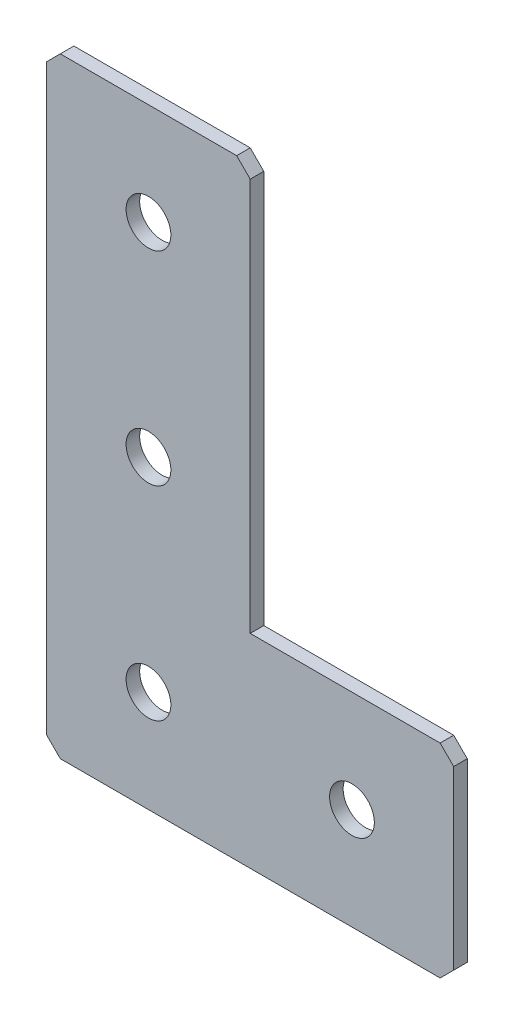
ISO-10303-21;
HEADER;
FILE_DESCRIPTION(('STEP AP214'),'2;1');
FILE_NAME('part.step','',(''),(''),'','','');
FILE_SCHEMA(('AUTOMOTIVE_DESIGN { 1 0 10303 214 1 1 1 1 }'));
ENDSEC;
DATA;
#1=APPLICATION_CONTEXT('core data for automotive mechanical design processes');
#2=APPLICATION_PROTOCOL_DEFINITION('international standard','automotive_design',2000,#1);
#3=PRODUCT_CONTEXT('',#1,'mechanical');
#4=PRODUCT('Part','Part','',(#3));
#5=PRODUCT_RELATED_PRODUCT_CATEGORY('part','',(#4));
#6=PRODUCT_DEFINITION_FORMATION('','',#4);
#7=PRODUCT_DEFINITION_CONTEXT('part definition',#1,'design');
#8=PRODUCT_DEFINITION('design','',#6,#7);
#9=PRODUCT_DEFINITION_SHAPE('','',#8);
#10=(LENGTH_UNIT() NAMED_UNIT(*) SI_UNIT(.MILLI.,.METRE.));
#11=(NAMED_UNIT(*) PLANE_ANGLE_UNIT() SI_UNIT($,.RADIAN.));
#12=(NAMED_UNIT(*) SI_UNIT($,.STERADIAN.) SOLID_ANGLE_UNIT());
#13=UNCERTAINTY_MEASURE_WITH_UNIT(LENGTH_MEASURE(1.E-05),#10,'distance_accuracy_value','');
#14=(GEOMETRIC_REPRESENTATION_CONTEXT(3) GLOBAL_UNCERTAINTY_ASSIGNED_CONTEXT((#13)) GLOBAL_UNIT_ASSIGNED_CONTEXT((#10,
#11,#12)) REPRESENTATION_CONTEXT('',''));
#15=CARTESIAN_POINT('',(0.,0.,0.));
#16=DIRECTION('',(0.,0.,1.));
#17=DIRECTION('',(1.,0.,0.));
#18=AXIS2_PLACEMENT_3D('',#15,#16,#17);
#19=CARTESIAN_POINT('',(30.,0.,-2.));
#20=DIRECTION('',(0.,-1.,0.));
#21=DIRECTION('',(1.,0.,0.));
#22=AXIS2_PLACEMENT_3D('',#19,#20,#21);
#23=PLANE('',#22);
#24=DIRECTION('',(1.,0.,0.));
#25=VECTOR('',#24,1.);
#26=CARTESIAN_POINT('',(30.,0.,-2.));
#27=LINE('',#26,#25);
#28=CARTESIAN_POINT('',(2.,0.,-2.));
#29=VERTEX_POINT('',#28);
#30=CARTESIAN_POINT('',(28.,0.,-2.));
#31=VERTEX_POINT('',#30);
#32=EDGE_CURVE('E143',#29,#31,#27,.T.);
#33=ORIENTED_EDGE('',*,*,#32,.F.);
#34=DIRECTION('',(0.,0.,1.));
#35=VECTOR('',#34,1.);
#36=CARTESIAN_POINT('',(2.,0.,-2.));
#37=LINE('',#36,#35);
#38=CARTESIAN_POINT('',(2.,0.,0.));
#39=VERTEX_POINT('',#38);
#40=EDGE_CURVE('E197',#29,#39,#37,.T.);
#41=ORIENTED_EDGE('',*,*,#40,.T.);
#42=DIRECTION('',(1.,0.,0.));
#43=VECTOR('',#42,1.);
#44=CARTESIAN_POINT('',(30.,0.,0.));
#45=LINE('',#44,#43);
#46=CARTESIAN_POINT('',(28.,0.,0.));
#47=VERTEX_POINT('',#46);
#48=EDGE_CURVE('E174',#39,#47,#45,.T.);
#49=ORIENTED_EDGE('',*,*,#48,.T.);
#50=DIRECTION('',(0.,0.,-1.));
#51=VECTOR('',#50,1.);
#52=CARTESIAN_POINT('',(28.,0.,-2.));
#53=LINE('',#52,#51);
#54=EDGE_CURVE('E154',#47,#31,#53,.T.);
#55=ORIENTED_EDGE('',*,*,#54,.T.);
#56=EDGE_LOOP('',(#33,#41,#49,#55));
#57=FACE_BOUND('',#56,.T.);
#58=ADVANCED_FACE('F45',(#57),#23,.F.);
#59=CARTESIAN_POINT('',(30.,-60.,-2.));
#60=DIRECTION('',(-1.,0.,0.));
#61=DIRECTION('',(0.,-1.,0.));
#62=AXIS2_PLACEMENT_3D('',#59,#60,#61);
#63=PLANE('',#62);
#64=DIRECTION('',(0.,-1.,0.));
#65=VECTOR('',#64,1.);
#66=CARTESIAN_POINT('',(30.,-60.,-2.));
#67=LINE('',#66,#65);
#68=CARTESIAN_POINT('',(30.,-2.00000000000002,-2.));
#69=VERTEX_POINT('',#68);
#70=CARTESIAN_POINT('',(30.,-60.,-2.));
#71=VERTEX_POINT('',#70);
#72=EDGE_CURVE('E129',#69,#71,#67,.T.);
#73=ORIENTED_EDGE('',*,*,#72,.F.);
#74=DIRECTION('',(0.,0.,1.));
#75=VECTOR('',#74,1.);
#76=CARTESIAN_POINT('',(30.,-2.00000000000002,-2.));
#77=LINE('',#76,#75);
#78=CARTESIAN_POINT('',(30.,-2.00000000000002,0.));
#79=VERTEX_POINT('',#78);
#80=EDGE_CURVE('E236',#69,#79,#77,.T.);
#81=ORIENTED_EDGE('',*,*,#80,.T.);
#82=DIRECTION('',(0.,-1.,0.));
#83=VECTOR('',#82,1.);
#84=CARTESIAN_POINT('',(30.,-60.,0.));
#85=LINE('',#84,#83);
#86=CARTESIAN_POINT('',(30.,-60.,0.));
#87=VERTEX_POINT('',#86);
#88=EDGE_CURVE('E149',#79,#87,#85,.T.);
#89=ORIENTED_EDGE('',*,*,#88,.T.);
#90=DIRECTION('',(0.,0.,1.));
#91=VECTOR('',#90,1.);
#92=CARTESIAN_POINT('',(30.,-60.,-2.));
#93=LINE('',#92,#91);
#94=EDGE_CURVE('E146',#71,#87,#93,.T.);
#95=ORIENTED_EDGE('',*,*,#94,.F.);
#96=EDGE_LOOP('',(#73,#81,#89,#95));
#97=FACE_BOUND('',#96,.T.);
#98=ADVANCED_FACE('F147',(#97),#63,.F.);
#99=CARTESIAN_POINT('',(60.,-60.,-2.));
#100=DIRECTION('',(0.,-1.,0.));
#101=DIRECTION('',(1.,0.,0.));
#102=AXIS2_PLACEMENT_3D('',#99,#100,#101);
#103=PLANE('',#102);
#104=DIRECTION('',(1.,0.,0.));
#105=VECTOR('',#104,1.);
#106=CARTESIAN_POINT('',(60.,-60.,0.));
#107=LINE('',#106,#105);
#108=CARTESIAN_POINT('',(58.,-60.,0.));
#109=VERTEX_POINT('',#108);
#110=EDGE_CURVE('E181',#87,#109,#107,.T.);
#111=ORIENTED_EDGE('',*,*,#110,.T.);
#112=DIRECTION('',(0.,0.,-1.));
#113=VECTOR('',#112,1.);
#114=CARTESIAN_POINT('',(58.,-60.,-2.));
#115=LINE('',#114,#113);
#116=CARTESIAN_POINT('',(58.,-60.,-2.));
#117=VERTEX_POINT('',#116);
#118=EDGE_CURVE('E159',#109,#117,#115,.T.);
#119=ORIENTED_EDGE('',*,*,#118,.T.);
#120=DIRECTION('',(1.,0.,0.));
#121=VECTOR('',#120,1.);
#122=CARTESIAN_POINT('',(60.,-60.,-2.));
#123=LINE('',#122,#121);
#124=EDGE_CURVE('E134',#71,#117,#123,.T.);
#125=ORIENTED_EDGE('',*,*,#124,.F.);
#126=ORIENTED_EDGE('',*,*,#94,.T.);
#127=EDGE_LOOP('',(#111,#119,#125,#126));
#128=FACE_BOUND('',#127,.T.);
#129=ADVANCED_FACE('F157',(#128),#103,.F.);
#130=CARTESIAN_POINT('',(60.,-90.,-2.));
#131=DIRECTION('',(-1.,0.,0.));
#132=DIRECTION('',(0.,-1.,0.));
#133=AXIS2_PLACEMENT_3D('',#130,#131,#132);
#134=PLANE('',#133);
#135=DIRECTION('',(0.,-1.,0.));
#136=VECTOR('',#135,1.);
#137=CARTESIAN_POINT('',(60.,-90.,-2.));
#138=LINE('',#137,#136);
#139=CARTESIAN_POINT('',(60.,-62.,-2.));
#140=VERTEX_POINT('',#139);
#141=CARTESIAN_POINT('',(60.,-88.,-2.));
#142=VERTEX_POINT('',#141);
#143=EDGE_CURVE('E161',#140,#142,#138,.T.);
#144=ORIENTED_EDGE('',*,*,#143,.F.);
#145=DIRECTION('',(0.,0.,1.));
#146=VECTOR('',#145,1.);
#147=CARTESIAN_POINT('',(60.,-62.,-2.));
#148=LINE('',#147,#146);
#149=CARTESIAN_POINT('',(60.,-62.,0.));
#150=VERTEX_POINT('',#149);
#151=EDGE_CURVE('E242',#140,#150,#148,.T.);
#152=ORIENTED_EDGE('',*,*,#151,.T.);
#153=DIRECTION('',(0.,-1.,0.));
#154=VECTOR('',#153,1.);
#155=CARTESIAN_POINT('',(60.,-90.,0.));
#156=LINE('',#155,#154);
#157=CARTESIAN_POINT('',(60.,-88.,0.));
#158=VERTEX_POINT('',#157);
#159=EDGE_CURVE('E184',#150,#158,#156,.T.);
#160=ORIENTED_EDGE('',*,*,#159,.T.);
#161=DIRECTION('',(0.,0.,-1.));
#162=VECTOR('',#161,1.);
#163=CARTESIAN_POINT('',(60.,-88.,-2.));
#164=LINE('',#163,#162);
#165=EDGE_CURVE('E239',#158,#142,#164,.T.);
#166=ORIENTED_EDGE('',*,*,#165,.T.);
#167=EDGE_LOOP('',(#144,#152,#160,#166));
#168=FACE_BOUND('',#167,.T.);
#169=ADVANCED_FACE('F437',(#168),#134,.F.);
#170=CARTESIAN_POINT('',(0.,-90.,-2.));
#171=DIRECTION('',(0.,1.,0.));
#172=DIRECTION('',(0.,0.,1.));
#173=AXIS2_PLACEMENT_3D('',#170,#171,#172);
#174=PLANE('',#173);
#175=DIRECTION('',(-1.,0.,0.));
#176=VECTOR('',#175,1.);
#177=CARTESIAN_POINT('',(0.,-90.,-2.));
#178=LINE('',#177,#176);
#179=CARTESIAN_POINT('',(58.,-90.,-2.));
#180=VERTEX_POINT('',#179);
#181=CARTESIAN_POINT('',(2.00000000000002,-90.,-2.));
#182=VERTEX_POINT('',#181);
#183=EDGE_CURVE('E166',#180,#182,#178,.T.);
#184=ORIENTED_EDGE('',*,*,#183,.F.);
#185=DIRECTION('',(0.,0.,1.));
#186=VECTOR('',#185,1.);
#187=CARTESIAN_POINT('',(58.,-90.,-2.));
#188=LINE('',#187,#186);
#189=CARTESIAN_POINT('',(58.,-90.,0.));
#190=VERTEX_POINT('',#189);
#191=EDGE_CURVE('E11',#180,#190,#188,.T.);
#192=ORIENTED_EDGE('',*,*,#191,.T.);
#193=DIRECTION('',(-1.,0.,0.));
#194=VECTOR('',#193,1.);
#195=CARTESIAN_POINT('',(0.,-90.,0.));
#196=LINE('',#195,#194);
#197=CARTESIAN_POINT('',(2.00000000000002,-90.,0.));
#198=VERTEX_POINT('',#197);
#199=EDGE_CURVE('E188',#190,#198,#196,.T.);
#200=ORIENTED_EDGE('',*,*,#199,.T.);
#201=DIRECTION('',(0.,0.,-1.));
#202=VECTOR('',#201,1.);
#203=CARTESIAN_POINT('',(2.00000000000002,-90.,-2.));
#204=LINE('',#203,#202);
#205=EDGE_CURVE('E54',#198,#182,#204,.T.);
#206=ORIENTED_EDGE('',*,*,#205,.T.);
#207=EDGE_LOOP('',(#184,#192,#200,#206));
#208=FACE_BOUND('',#207,.T.);
#209=ADVANCED_FACE('F421',(#208),#174,.F.);
#210=CARTESIAN_POINT('',(0.,0.,-2.));
#211=DIRECTION('',(1.,0.,0.));
#212=DIRECTION('',(0.,0.,-1.));
#213=AXIS2_PLACEMENT_3D('',#210,#211,#212);
#214=PLANE('',#213);
#215=DIRECTION('',(0.,1.,0.));
#216=VECTOR('',#215,1.);
#217=CARTESIAN_POINT('',(0.,0.,0.));
#218=LINE('',#217,#216);
#219=CARTESIAN_POINT('',(0.,-88.,0.));
#220=VERTEX_POINT('',#219);
#221=CARTESIAN_POINT('',(0.,-2.00000000000001,0.));
#222=VERTEX_POINT('',#221);
#223=EDGE_CURVE('E191',#220,#222,#218,.T.);
#224=ORIENTED_EDGE('',*,*,#223,.T.);
#225=DIRECTION('',(0.,0.,-1.));
#226=VECTOR('',#225,1.);
#227=CARTESIAN_POINT('',(0.,-2.00000000000002,-2.));
#228=LINE('',#227,#226);
#229=CARTESIAN_POINT('',(0.,-2.00000000000001,-2.));
#230=VERTEX_POINT('',#229);
#231=EDGE_CURVE('E220',#222,#230,#228,.T.);
#232=ORIENTED_EDGE('',*,*,#231,.T.);
#233=DIRECTION('',(0.,1.,0.));
#234=VECTOR('',#233,1.);
#235=CARTESIAN_POINT('',(0.,0.,-2.));
#236=LINE('',#235,#234);
#237=CARTESIAN_POINT('',(0.,-88.,-2.));
#238=VERTEX_POINT('',#237);
#239=EDGE_CURVE('E155',#238,#230,#236,.T.);
#240=ORIENTED_EDGE('',*,*,#239,.F.);
#241=DIRECTION('',(0.,0.,1.));
#242=VECTOR('',#241,1.);
#243=CARTESIAN_POINT('',(0.,-88.,-2.));
#244=LINE('',#243,#242);
#245=EDGE_CURVE('E216',#238,#220,#244,.T.);
#246=ORIENTED_EDGE('',*,*,#245,.T.);
#247=EDGE_LOOP('',(#224,#232,#240,#246));
#248=FACE_BOUND('',#247,.T.);
#249=ADVANCED_FACE('F367',(#248),#214,.F.);
#250=CARTESIAN_POINT('',(0.,0.,-2.));
#251=DIRECTION('',(0.,0.,1.));
#252=DIRECTION('',(1.,0.,0.));
#253=AXIS2_PLACEMENT_3D('',#250,#251,#252);
#254=PLANE('',#253);
#255=CARTESIAN_POINT('',(45.,-75.,-2.));
#256=DIRECTION('',(0.,0.,-1.));
#257=DIRECTION('',(0.,1.,0.));
#258=AXIS2_PLACEMENT_3D('',#255,#256,#257);
#259=CIRCLE('',#258,3.3);
#260=CARTESIAN_POINT('',(45.,-71.7,-2.));
#261=VERTEX_POINT('',#260);
#262=EDGE_CURVE('E354',#261,#261,#259,.T.);
#263=ORIENTED_EDGE('',*,*,#262,.F.);
#264=EDGE_LOOP('',(#263));
#265=FACE_BOUND('',#264,.T.);
#266=CARTESIAN_POINT('',(15.,-75.,-2.));
#267=DIRECTION('',(0.,0.,-1.));
#268=DIRECTION('',(0.,1.,0.));
#269=AXIS2_PLACEMENT_3D('',#266,#267,#268);
#270=CIRCLE('',#269,3.3);
#271=CARTESIAN_POINT('',(15.,-71.7,-2.));
#272=VERTEX_POINT('',#271);
#273=EDGE_CURVE('E344',#272,#272,#270,.T.);
#274=ORIENTED_EDGE('',*,*,#273,.F.);
#275=EDGE_LOOP('',(#274));
#276=FACE_BOUND('',#275,.T.);
#277=CARTESIAN_POINT('',(15.,-45.,-2.));
#278=DIRECTION('',(0.,0.,-1.));
#279=DIRECTION('',(0.,1.,0.));
#280=AXIS2_PLACEMENT_3D('',#277,#278,#279);
#281=CIRCLE('',#280,3.3);
#282=CARTESIAN_POINT('',(15.,-41.7,-2.));
#283=VERTEX_POINT('',#282);
#284=EDGE_CURVE('E333',#283,#283,#281,.T.);
#285=ORIENTED_EDGE('',*,*,#284,.F.);
#286=EDGE_LOOP('',(#285));
#287=FACE_BOUND('',#286,.T.);
#288=CARTESIAN_POINT('',(15.,-15.,-2.));
#289=DIRECTION('',(0.,0.,-1.));
#290=DIRECTION('',(0.,1.,0.));
#291=AXIS2_PLACEMENT_3D('',#288,#289,#290);
#292=CIRCLE('',#291,3.3);
#293=CARTESIAN_POINT('',(15.,-11.7,-2.));
#294=VERTEX_POINT('',#293);
#295=EDGE_CURVE('E314',#294,#294,#292,.T.);
#296=ORIENTED_EDGE('',*,*,#295,.F.);
#297=EDGE_LOOP('',(#296));
#298=FACE_BOUND('',#297,.T.);
#299=ORIENTED_EDGE('',*,*,#239,.T.);
#300=DIRECTION('',(-0.707106781186545,-0.70710678118655,0.));
#301=VECTOR('',#300,1.);
#302=CARTESIAN_POINT('',(2.,0.,-2.));
#303=LINE('',#302,#301);
#304=EDGE_CURVE('E233',#230,#29,#303,.F.);
#305=ORIENTED_EDGE('',*,*,#304,.T.);
#306=ORIENTED_EDGE('',*,*,#32,.T.);
#307=DIRECTION('',(-0.70710678118655,0.707106781186545,0.));
#308=VECTOR('',#307,1.);
#309=CARTESIAN_POINT('',(30.,-2.00000000000002,-2.));
#310=LINE('',#309,#308);
#311=EDGE_CURVE('E138',#31,#69,#310,.F.);
#312=ORIENTED_EDGE('',*,*,#311,.T.);
#313=ORIENTED_EDGE('',*,*,#72,.T.);
#314=ORIENTED_EDGE('',*,*,#124,.T.);
#315=DIRECTION('',(-0.70710678118655,0.707106781186545,0.));
#316=VECTOR('',#315,1.);
#317=CARTESIAN_POINT('',(60.,-62.,-2.));
#318=LINE('',#317,#316);
#319=EDGE_CURVE('E228',#117,#140,#318,.F.);
#320=ORIENTED_EDGE('',*,*,#319,.T.);
#321=ORIENTED_EDGE('',*,*,#143,.T.);
#322=DIRECTION('',(0.707106781186545,0.70710678118655,0.));
#323=VECTOR('',#322,1.);
#324=CARTESIAN_POINT('',(58.,-90.,-2.));
#325=LINE('',#324,#323);
#326=EDGE_CURVE('E67',#142,#180,#325,.F.);
#327=ORIENTED_EDGE('',*,*,#326,.T.);
#328=ORIENTED_EDGE('',*,*,#183,.T.);
#329=DIRECTION('',(0.707106781186552,-0.707106781186543,0.));
#330=VECTOR('',#329,1.);
#331=CARTESIAN_POINT('',(0.,-88.,-2.));
#332=LINE('',#331,#330);
#333=EDGE_CURVE('E223',#182,#238,#332,.F.);
#334=ORIENTED_EDGE('',*,*,#333,.T.);
#335=EDGE_LOOP('',(#299,#305,#306,#312,#313,#314,#320,#321,#327,#328,#334));
#336=FACE_BOUND('',#335,.T.);
#337=ADVANCED_FACE('F132',(#265,#276,#287,#298,#336),#254,.F.);
#338=CARTESIAN_POINT('',(0.,0.,0.));
#339=DIRECTION('',(0.,0.,1.));
#340=DIRECTION('',(1.,0.,0.));
#341=AXIS2_PLACEMENT_3D('',#338,#339,#340);
#342=PLANE('',#341);
#343=CARTESIAN_POINT('',(45.,-75.,0.));
#344=DIRECTION('',(0.,0.,-1.));
#345=DIRECTION('',(0.,1.,0.));
#346=AXIS2_PLACEMENT_3D('',#343,#344,#345);
#347=CIRCLE('',#346,3.3);
#348=CARTESIAN_POINT('',(45.,-71.7,0.));
#349=VERTEX_POINT('',#348);
#350=EDGE_CURVE('E349',#349,#349,#347,.T.);
#351=ORIENTED_EDGE('',*,*,#350,.T.);
#352=EDGE_LOOP('',(#351));
#353=FACE_BOUND('',#352,.T.);
#354=CARTESIAN_POINT('',(15.,-75.,0.));
#355=DIRECTION('',(0.,0.,-1.));
#356=DIRECTION('',(0.,1.,0.));
#357=AXIS2_PLACEMENT_3D('',#354,#355,#356);
#358=CIRCLE('',#357,3.3);
#359=CARTESIAN_POINT('',(15.,-71.7,0.));
#360=VERTEX_POINT('',#359);
#361=EDGE_CURVE('E339',#360,#360,#358,.T.);
#362=ORIENTED_EDGE('',*,*,#361,.T.);
#363=EDGE_LOOP('',(#362));
#364=FACE_BOUND('',#363,.T.);
#365=CARTESIAN_POINT('',(15.,-45.,0.));
#366=DIRECTION('',(0.,0.,-1.));
#367=DIRECTION('',(0.,1.,0.));
#368=AXIS2_PLACEMENT_3D('',#365,#366,#367);
#369=CIRCLE('',#368,3.3);
#370=CARTESIAN_POINT('',(15.,-41.7,0.));
#371=VERTEX_POINT('',#370);
#372=EDGE_CURVE('E327',#371,#371,#369,.T.);
#373=ORIENTED_EDGE('',*,*,#372,.T.);
#374=EDGE_LOOP('',(#373));
#375=FACE_BOUND('',#374,.T.);
#376=CARTESIAN_POINT('',(15.,-15.,0.));
#377=DIRECTION('',(0.,0.,-1.));
#378=DIRECTION('',(0.,1.,0.));
#379=AXIS2_PLACEMENT_3D('',#376,#377,#378);
#380=CIRCLE('',#379,3.3);
#381=CARTESIAN_POINT('',(15.,-11.7,0.));
#382=VERTEX_POINT('',#381);
#383=EDGE_CURVE('E178',#382,#382,#380,.T.);
#384=ORIENTED_EDGE('',*,*,#383,.T.);
#385=EDGE_LOOP('',(#384));
#386=FACE_BOUND('',#385,.T.);
#387=ORIENTED_EDGE('',*,*,#48,.F.);
#388=DIRECTION('',(0.707106781186545,0.70710678118655,0.));
#389=VECTOR('',#388,1.);
#390=CARTESIAN_POINT('',(1.00000000000001,-1.,0.));
#391=LINE('',#390,#389);
#392=EDGE_CURVE('E213',#39,#222,#391,.F.);
#393=ORIENTED_EDGE('',*,*,#392,.T.);
#394=ORIENTED_EDGE('',*,*,#223,.F.);
#395=DIRECTION('',(-0.707106781186552,0.707106781186543,0.));
#396=VECTOR('',#395,1.);
#397=CARTESIAN_POINT('',(-44.,-44.0000000000006,0.));
#398=LINE('',#397,#396);
#399=EDGE_CURVE('E201',#220,#198,#398,.F.);
#400=ORIENTED_EDGE('',*,*,#399,.T.);
#401=ORIENTED_EDGE('',*,*,#199,.F.);
#402=DIRECTION('',(-0.707106781186545,-0.70710678118655,0.));
#403=VECTOR('',#402,1.);
#404=CARTESIAN_POINT('',(74.0000000000002,-73.9999999999997,0.));
#405=LINE('',#404,#403);
#406=EDGE_CURVE('E204',#190,#158,#405,.F.);
#407=ORIENTED_EDGE('',*,*,#406,.T.);
#408=ORIENTED_EDGE('',*,*,#159,.F.);
#409=DIRECTION('',(0.70710678118655,-0.707106781186545,0.));
#410=VECTOR('',#409,1.);
#411=CARTESIAN_POINT('',(-1.0000000000002,-1.00000000000021,0.));
#412=LINE('',#411,#410);
#413=EDGE_CURVE('E207',#150,#109,#412,.F.);
#414=ORIENTED_EDGE('',*,*,#413,.T.);
#415=ORIENTED_EDGE('',*,*,#110,.F.);
#416=ORIENTED_EDGE('',*,*,#88,.F.);
#417=DIRECTION('',(0.70710678118655,-0.707106781186545,0.));
#418=VECTOR('',#417,1.);
#419=CARTESIAN_POINT('',(13.9999999999999,14.,0.));
#420=LINE('',#419,#418);
#421=EDGE_CURVE('E210',#79,#47,#420,.F.);
#422=ORIENTED_EDGE('',*,*,#421,.T.);
#423=EDGE_LOOP('',(#387,#393,#394,#400,#401,#407,#408,#414,#415,#416,#422));
#424=FACE_BOUND('',#423,.T.);
#425=ADVANCED_FACE('F366',(#353,#364,#375,#386,#424),#342,.T.);
#426=CARTESIAN_POINT('',(15.,-15.,-2.));
#427=DIRECTION('',(0.,0.,-1.));
#428=DIRECTION('',(0.,1.,0.));
#429=AXIS2_PLACEMENT_3D('',#426,#427,#428);
#430=CYLINDRICAL_SURFACE('',#429,3.3);
#431=ORIENTED_EDGE('',*,*,#383,.F.);
#432=EDGE_LOOP('',(#431));
#433=FACE_BOUND('',#432,.T.);
#434=ORIENTED_EDGE('',*,*,#295,.T.);
#435=EDGE_LOOP('',(#434));
#436=FACE_BOUND('',#435,.T.);
#437=ADVANCED_FACE('F375',(#433,#436),#430,.F.);
#438=CARTESIAN_POINT('',(15.,-45.,-2.));
#439=DIRECTION('',(0.,0.,-1.));
#440=DIRECTION('',(0.,1.,0.));
#441=AXIS2_PLACEMENT_3D('',#438,#439,#440);
#442=CYLINDRICAL_SURFACE('',#441,3.3);
#443=ORIENTED_EDGE('',*,*,#372,.F.);
#444=EDGE_LOOP('',(#443));
#445=FACE_BOUND('',#444,.T.);
#446=ORIENTED_EDGE('',*,*,#284,.T.);
#447=EDGE_LOOP('',(#446));
#448=FACE_BOUND('',#447,.T.);
#449=ADVANCED_FACE('F377',(#445,#448),#442,.F.);
#450=CARTESIAN_POINT('',(15.,-75.,-2.));
#451=DIRECTION('',(0.,0.,-1.));
#452=DIRECTION('',(0.,1.,0.));
#453=AXIS2_PLACEMENT_3D('',#450,#451,#452);
#454=CYLINDRICAL_SURFACE('',#453,3.3);
#455=ORIENTED_EDGE('',*,*,#361,.F.);
#456=EDGE_LOOP('',(#455));
#457=FACE_BOUND('',#456,.T.);
#458=ORIENTED_EDGE('',*,*,#273,.T.);
#459=EDGE_LOOP('',(#458));
#460=FACE_BOUND('',#459,.T.);
#461=ADVANCED_FACE('F384',(#457,#460),#454,.F.);
#462=CARTESIAN_POINT('',(45.,-75.,-2.));
#463=DIRECTION('',(0.,0.,-1.));
#464=DIRECTION('',(0.,1.,0.));
#465=AXIS2_PLACEMENT_3D('',#462,#463,#464);
#466=CYLINDRICAL_SURFACE('',#465,3.3);
#467=ORIENTED_EDGE('',*,*,#350,.F.);
#468=EDGE_LOOP('',(#467));
#469=FACE_BOUND('',#468,.T.);
#470=ORIENTED_EDGE('',*,*,#262,.T.);
#471=EDGE_LOOP('',(#470));
#472=FACE_BOUND('',#471,.T.);
#473=ADVANCED_FACE('F362',(#469,#472),#466,.F.);
#474=CARTESIAN_POINT('',(2.,0.,-2.));
#475=DIRECTION('',(0.70710678118655,-0.707106781186545,0.));
#476=DIRECTION('',(0.,0.,1.));
#477=AXIS2_PLACEMENT_3D('',#474,#475,#476);
#478=PLANE('',#477);
#479=ORIENTED_EDGE('',*,*,#304,.F.);
#480=ORIENTED_EDGE('',*,*,#231,.F.);
#481=ORIENTED_EDGE('',*,*,#392,.F.);
#482=ORIENTED_EDGE('',*,*,#40,.F.);
#483=EDGE_LOOP('',(#479,#480,#481,#482));
#484=FACE_BOUND('',#483,.T.);
#485=ADVANCED_FACE('F400',(#484),#478,.F.);
#486=CARTESIAN_POINT('',(30.,-2.00000000000002,-2.));
#487=DIRECTION('',(-0.707106781186545,-0.70710678118655,0.));
#488=DIRECTION('',(0.,0.,1.));
#489=AXIS2_PLACEMENT_3D('',#486,#487,#488);
#490=PLANE('',#489);
#491=ORIENTED_EDGE('',*,*,#311,.F.);
#492=ORIENTED_EDGE('',*,*,#54,.F.);
#493=ORIENTED_EDGE('',*,*,#421,.F.);
#494=ORIENTED_EDGE('',*,*,#80,.F.);
#495=EDGE_LOOP('',(#491,#492,#493,#494));
#496=FACE_BOUND('',#495,.T.);
#497=ADVANCED_FACE('F403',(#496),#490,.F.);
#498=CARTESIAN_POINT('',(60.,-62.,-2.));
#499=DIRECTION('',(-0.707106781186545,-0.70710678118655,0.));
#500=DIRECTION('',(0.,0.,1.));
#501=AXIS2_PLACEMENT_3D('',#498,#499,#500);
#502=PLANE('',#501);
#503=ORIENTED_EDGE('',*,*,#319,.F.);
#504=ORIENTED_EDGE('',*,*,#118,.F.);
#505=ORIENTED_EDGE('',*,*,#413,.F.);
#506=ORIENTED_EDGE('',*,*,#151,.F.);
#507=EDGE_LOOP('',(#503,#504,#505,#506));
#508=FACE_BOUND('',#507,.T.);
#509=ADVANCED_FACE('F407',(#508),#502,.F.);
#510=CARTESIAN_POINT('',(58.,-90.,-2.));
#511=DIRECTION('',(-0.70710678118655,0.707106781186545,0.));
#512=DIRECTION('',(0.,0.,1.));
#513=AXIS2_PLACEMENT_3D('',#510,#511,#512);
#514=PLANE('',#513);
#515=ORIENTED_EDGE('',*,*,#326,.F.);
#516=ORIENTED_EDGE('',*,*,#165,.F.);
#517=ORIENTED_EDGE('',*,*,#406,.F.);
#518=ORIENTED_EDGE('',*,*,#191,.F.);
#519=EDGE_LOOP('',(#515,#516,#517,#518));
#520=FACE_BOUND('',#519,.T.);
#521=ADVANCED_FACE('F410',(#520),#514,.F.);
#522=CARTESIAN_POINT('',(0.,-88.,-2.));
#523=DIRECTION('',(0.707106781186543,0.707106781186552,0.));
#524=DIRECTION('',(0.,0.,1.));
#525=AXIS2_PLACEMENT_3D('',#522,#523,#524);
#526=PLANE('',#525);
#527=ORIENTED_EDGE('',*,*,#333,.F.);
#528=ORIENTED_EDGE('',*,*,#205,.F.);
#529=ORIENTED_EDGE('',*,*,#399,.F.);
#530=ORIENTED_EDGE('',*,*,#245,.F.);
#531=EDGE_LOOP('',(#527,#528,#529,#530));
#532=FACE_BOUND('',#531,.T.);
#533=ADVANCED_FACE('F47',(#532),#526,.F.);
#534=CLOSED_SHELL('',(#58,#98,#129,#169,#209,#249,#337,#425,#437,#449,#461,#473,#485,#497,#509,
#521,#533));
#535=MANIFOLD_SOLID_BREP('B2',#534);
#536=ADVANCED_BREP_SHAPE_REPRESENTATION('',(#18,#535),#14);
#537=SHAPE_DEFINITION_REPRESENTATION(#9,#536);
ENDSEC;
END-ISO-10303-21;
